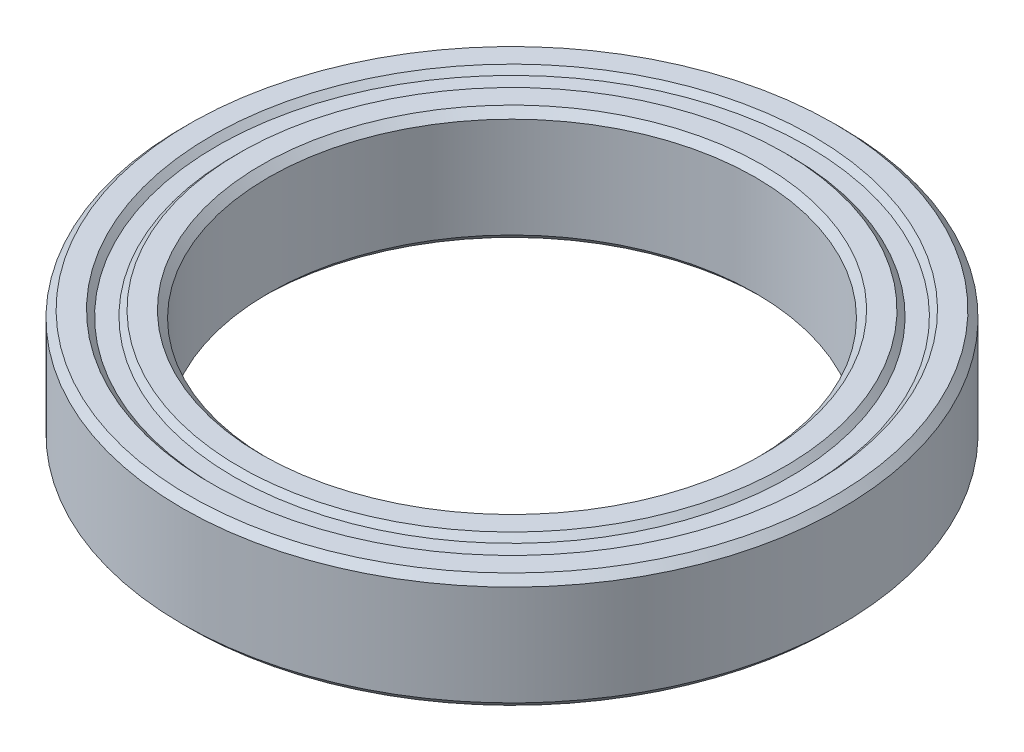
ISO-10303-21;
HEADER;
FILE_DESCRIPTION(('STEP AP214'),'2;1');
FILE_NAME('part.step','',(''),(''),'','','');
FILE_SCHEMA(('AUTOMOTIVE_DESIGN { 1 0 10303 214 1 1 1 1 }'));
ENDSEC;
DATA;
#1=APPLICATION_CONTEXT('core data for automotive mechanical design processes');
#2=APPLICATION_PROTOCOL_DEFINITION('international standard','automotive_design',2000,#1);
#3=PRODUCT_CONTEXT('',#1,'mechanical');
#4=PRODUCT('Part','Part','',(#3));
#5=PRODUCT_RELATED_PRODUCT_CATEGORY('part','',(#4));
#6=PRODUCT_DEFINITION_FORMATION('','',#4);
#7=PRODUCT_DEFINITION_CONTEXT('part definition',#1,'design');
#8=PRODUCT_DEFINITION('design','',#6,#7);
#9=PRODUCT_DEFINITION_SHAPE('','',#8);
#10=(LENGTH_UNIT() NAMED_UNIT(*) SI_UNIT(.MILLI.,.METRE.));
#11=(NAMED_UNIT(*) PLANE_ANGLE_UNIT() SI_UNIT($,.RADIAN.));
#12=(NAMED_UNIT(*) SI_UNIT($,.STERADIAN.) SOLID_ANGLE_UNIT());
#13=UNCERTAINTY_MEASURE_WITH_UNIT(LENGTH_MEASURE(1.E-05),#10,'distance_accuracy_value','');
#14=(GEOMETRIC_REPRESENTATION_CONTEXT(3) GLOBAL_UNCERTAINTY_ASSIGNED_CONTEXT((#13)) GLOBAL_UNIT_ASSIGNED_CONTEXT((#10,
#11,#12)) REPRESENTATION_CONTEXT('',''));
#15=CARTESIAN_POINT('',(0.,0.,0.));
#16=DIRECTION('',(0.,0.,1.));
#17=DIRECTION('',(1.,0.,0.));
#18=AXIS2_PLACEMENT_3D('',#15,#16,#17);
#19=CARTESIAN_POINT('',(0.,2.,0.));
#20=DIRECTION('',(0.,1.,0.));
#21=DIRECTION('',(0.,0.,1.));
#22=AXIS2_PLACEMENT_3D('',#19,#20,#21);
#23=CONICAL_SURFACE('',#22,8.75,0.785398163397448);
#24=CARTESIAN_POINT('',(0.,1.75,0.));
#25=DIRECTION('',(0.,-1.,0.));
#26=DIRECTION('',(0.,0.,-1.));
#27=AXIS2_PLACEMENT_3D('',#24,#25,#26);
#28=CIRCLE('',#27,8.5);
#29=CARTESIAN_POINT('',(0.,1.75,-8.5));
#30=VERTEX_POINT('',#29);
#31=EDGE_CURVE('E10',#30,#30,#28,.T.);
#32=ORIENTED_EDGE('',*,*,#31,.T.);
#33=EDGE_LOOP('',(#32));
#34=FACE_BOUND('',#33,.T.);
#35=CARTESIAN_POINT('',(0.,2.,0.));
#36=DIRECTION('',(0.,-1.,0.));
#37=DIRECTION('',(0.,0.,-1.));
#38=AXIS2_PLACEMENT_3D('',#35,#36,#37);
#39=CIRCLE('',#38,8.75);
#40=CARTESIAN_POINT('',(0.,2.,-8.75));
#41=VERTEX_POINT('',#40);
#42=EDGE_CURVE('E89',#41,#41,#39,.T.);
#43=ORIENTED_EDGE('',*,*,#42,.F.);
#44=EDGE_LOOP('',(#43));
#45=FACE_BOUND('',#44,.T.);
#46=ADVANCED_FACE('F37',(#34,#45),#23,.F.);
#47=CARTESIAN_POINT('',(0.,-1.34942197217015,0.));
#48=DIRECTION('',(0.,-1.,0.));
#49=DIRECTION('',(0.,0.,-1.));
#50=AXIS2_PLACEMENT_3D('',#47,#48,#49);
#51=CYLINDRICAL_SURFACE('',#50,8.5);
#52=CARTESIAN_POINT('',(0.,-1.75,0.));
#53=DIRECTION('',(0.,-1.,0.));
#54=DIRECTION('',(0.,0.,-1.));
#55=AXIS2_PLACEMENT_3D('',#52,#53,#54);
#56=CIRCLE('',#55,8.5);
#57=CARTESIAN_POINT('',(0.,-1.75,-8.5));
#58=VERTEX_POINT('',#57);
#59=EDGE_CURVE('E43',#58,#58,#56,.T.);
#60=ORIENTED_EDGE('',*,*,#59,.T.);
#61=EDGE_LOOP('',(#60));
#62=FACE_BOUND('',#61,.T.);
#63=ORIENTED_EDGE('',*,*,#31,.F.);
#64=EDGE_LOOP('',(#63));
#65=FACE_BOUND('',#64,.T.);
#66=ADVANCED_FACE('F97',(#62,#65),#51,.F.);
#67=CARTESIAN_POINT('',(0.,-1.75,0.));
#68=DIRECTION('',(0.,-1.,0.));
#69=DIRECTION('',(0.,0.,-1.));
#70=AXIS2_PLACEMENT_3D('',#67,#68,#69);
#71=CONICAL_SURFACE('',#70,8.5,0.785398163397449);
#72=CARTESIAN_POINT('',(0.,-2.,0.));
#73=DIRECTION('',(0.,-1.,0.));
#74=DIRECTION('',(0.,0.,-1.));
#75=AXIS2_PLACEMENT_3D('',#72,#73,#74);
#76=CIRCLE('',#75,8.75);
#77=CARTESIAN_POINT('',(0.,-2.,-8.75));
#78=VERTEX_POINT('',#77);
#79=EDGE_CURVE('E47',#78,#78,#76,.T.);
#80=ORIENTED_EDGE('',*,*,#79,.T.);
#81=EDGE_LOOP('',(#80));
#82=FACE_BOUND('',#81,.T.);
#83=ORIENTED_EDGE('',*,*,#59,.F.);
#84=EDGE_LOOP('',(#83));
#85=FACE_BOUND('',#84,.T.);
#86=ADVANCED_FACE('F101',(#82,#85),#71,.F.);
#87=CARTESIAN_POINT('',(8.75,-2.,0.));
#88=DIRECTION('',(0.,-1.,0.));
#89=DIRECTION('',(0.,0.,-1.));
#90=AXIS2_PLACEMENT_3D('',#87,#88,#89);
#91=PLANE('',#90);
#92=CARTESIAN_POINT('',(0.,-2.,0.));
#93=DIRECTION('',(0.,-1.,0.));
#94=DIRECTION('',(0.,0.,-1.));
#95=AXIS2_PLACEMENT_3D('',#92,#93,#94);
#96=CIRCLE('',#95,9.5);
#97=CARTESIAN_POINT('',(0.,-2.,-9.5));
#98=VERTEX_POINT('',#97);
#99=EDGE_CURVE('E51',#98,#98,#96,.T.);
#100=ORIENTED_EDGE('',*,*,#99,.T.);
#101=EDGE_LOOP('',(#100));
#102=FACE_BOUND('',#101,.T.);
#103=ORIENTED_EDGE('',*,*,#79,.F.);
#104=EDGE_LOOP('',(#103));
#105=FACE_BOUND('',#104,.T.);
#106=ADVANCED_FACE('F105',(#102,#105),#91,.T.);
#107=CARTESIAN_POINT('',(0.,-2.,0.));
#108=DIRECTION('',(0.,1.,0.));
#109=DIRECTION('',(0.,0.,1.));
#110=AXIS2_PLACEMENT_3D('',#107,#108,#109);
#111=CONICAL_SURFACE('',#110,9.5,0.78539816339745);
#112=CARTESIAN_POINT('',(0.,-1.8,0.));
#113=DIRECTION('',(0.,-1.,0.));
#114=DIRECTION('',(0.,0.,-1.));
#115=AXIS2_PLACEMENT_3D('',#112,#113,#114);
#116=CIRCLE('',#115,9.7);
#117=CARTESIAN_POINT('',(0.,-1.8,-9.7));
#118=VERTEX_POINT('',#117);
#119=EDGE_CURVE('E56',#118,#118,#116,.T.);
#120=ORIENTED_EDGE('',*,*,#119,.T.);
#121=EDGE_LOOP('',(#120));
#122=FACE_BOUND('',#121,.T.);
#123=ORIENTED_EDGE('',*,*,#99,.F.);
#124=EDGE_LOOP('',(#123));
#125=FACE_BOUND('',#124,.T.);
#126=ADVANCED_FACE('F112',(#122,#125),#111,.T.);
#127=CARTESIAN_POINT('',(9.7,-1.8,0.));
#128=DIRECTION('',(0.,-1.,0.));
#129=DIRECTION('',(0.,0.,-1.));
#130=AXIS2_PLACEMENT_3D('',#127,#128,#129);
#131=PLANE('',#130);
#132=CARTESIAN_POINT('',(0.,-1.8,0.));
#133=DIRECTION('',(0.,-1.,0.));
#134=DIRECTION('',(0.,0.,-1.));
#135=AXIS2_PLACEMENT_3D('',#132,#133,#134);
#136=CIRCLE('',#135,10.3);
#137=CARTESIAN_POINT('',(0.,-1.8,-10.3));
#138=VERTEX_POINT('',#137);
#139=EDGE_CURVE('E59',#138,#138,#136,.T.);
#140=ORIENTED_EDGE('',*,*,#139,.T.);
#141=EDGE_LOOP('',(#140));
#142=FACE_BOUND('',#141,.T.);
#143=ORIENTED_EDGE('',*,*,#119,.F.);
#144=EDGE_LOOP('',(#143));
#145=FACE_BOUND('',#144,.T.);
#146=ADVANCED_FACE('F116',(#142,#145),#131,.T.);
#147=CARTESIAN_POINT('',(0.,-1.8,0.));
#148=DIRECTION('',(0.,-1.,0.));
#149=DIRECTION('',(0.,0.,-1.));
#150=AXIS2_PLACEMENT_3D('',#147,#148,#149);
#151=CONICAL_SURFACE('',#150,10.3,0.78539816339745);
#152=CARTESIAN_POINT('',(0.,-2.,0.));
#153=DIRECTION('',(0.,-1.,0.));
#154=DIRECTION('',(0.,0.,-1.));
#155=AXIS2_PLACEMENT_3D('',#152,#153,#154);
#156=CIRCLE('',#155,10.5);
#157=CARTESIAN_POINT('',(0.,-2.,-10.5));
#158=VERTEX_POINT('',#157);
#159=EDGE_CURVE('E62',#158,#158,#156,.T.);
#160=ORIENTED_EDGE('',*,*,#159,.T.);
#161=EDGE_LOOP('',(#160));
#162=FACE_BOUND('',#161,.T.);
#163=ORIENTED_EDGE('',*,*,#139,.F.);
#164=EDGE_LOOP('',(#163));
#165=FACE_BOUND('',#164,.T.);
#166=ADVANCED_FACE('F120',(#162,#165),#151,.F.);
#167=CARTESIAN_POINT('',(10.5,-2.,0.));
#168=DIRECTION('',(0.,-1.,0.));
#169=DIRECTION('',(0.,0.,-1.));
#170=AXIS2_PLACEMENT_3D('',#167,#168,#169);
#171=PLANE('',#170);
#172=CARTESIAN_POINT('',(0.,-2.,0.));
#173=DIRECTION('',(0.,-1.,0.));
#174=DIRECTION('',(0.,0.,-1.));
#175=AXIS2_PLACEMENT_3D('',#172,#173,#174);
#176=CIRCLE('',#175,11.25);
#177=CARTESIAN_POINT('',(0.,-2.,-11.25));
#178=VERTEX_POINT('',#177);
#179=EDGE_CURVE('E65',#178,#178,#176,.T.);
#180=ORIENTED_EDGE('',*,*,#179,.T.);
#181=EDGE_LOOP('',(#180));
#182=FACE_BOUND('',#181,.T.);
#183=ORIENTED_EDGE('',*,*,#159,.F.);
#184=EDGE_LOOP('',(#183));
#185=FACE_BOUND('',#184,.T.);
#186=ADVANCED_FACE('F124',(#182,#185),#171,.T.);
#187=CARTESIAN_POINT('',(0.,-2.,0.));
#188=DIRECTION('',(0.,1.,0.));
#189=DIRECTION('',(0.,0.,1.));
#190=AXIS2_PLACEMENT_3D('',#187,#188,#189);
#191=CONICAL_SURFACE('',#190,11.25,0.785398163397449);
#192=CARTESIAN_POINT('',(0.,-1.75,0.));
#193=DIRECTION('',(0.,-1.,0.));
#194=DIRECTION('',(0.,0.,-1.));
#195=AXIS2_PLACEMENT_3D('',#192,#193,#194);
#196=CIRCLE('',#195,11.5);
#197=CARTESIAN_POINT('',(0.,-1.75,-11.5));
#198=VERTEX_POINT('',#197);
#199=EDGE_CURVE('E68',#198,#198,#196,.T.);
#200=ORIENTED_EDGE('',*,*,#199,.T.);
#201=EDGE_LOOP('',(#200));
#202=FACE_BOUND('',#201,.T.);
#203=ORIENTED_EDGE('',*,*,#179,.F.);
#204=EDGE_LOOP('',(#203));
#205=FACE_BOUND('',#204,.T.);
#206=ADVANCED_FACE('F128',(#202,#205),#191,.T.);
#207=CARTESIAN_POINT('',(0.,-1.34942197217015,0.));
#208=DIRECTION('',(0.,-1.,0.));
#209=DIRECTION('',(0.,0.,-1.));
#210=AXIS2_PLACEMENT_3D('',#207,#208,#209);
#211=CYLINDRICAL_SURFACE('',#210,11.5);
#212=CARTESIAN_POINT('',(0.,1.75,0.));
#213=DIRECTION('',(0.,-1.,0.));
#214=DIRECTION('',(0.,0.,-1.));
#215=AXIS2_PLACEMENT_3D('',#212,#213,#214);
#216=CIRCLE('',#215,11.5);
#217=CARTESIAN_POINT('',(0.,1.75,-11.5));
#218=VERTEX_POINT('',#217);
#219=EDGE_CURVE('E71',#218,#218,#216,.T.);
#220=ORIENTED_EDGE('',*,*,#219,.T.);
#221=EDGE_LOOP('',(#220));
#222=FACE_BOUND('',#221,.T.);
#223=ORIENTED_EDGE('',*,*,#199,.F.);
#224=EDGE_LOOP('',(#223));
#225=FACE_BOUND('',#224,.T.);
#226=ADVANCED_FACE('F132',(#222,#225),#211,.T.);
#227=CARTESIAN_POINT('',(0.,1.75,0.));
#228=DIRECTION('',(0.,-1.,0.));
#229=DIRECTION('',(0.,0.,-1.));
#230=AXIS2_PLACEMENT_3D('',#227,#228,#229);
#231=CONICAL_SURFACE('',#230,11.5,0.785398163397451);
#232=CARTESIAN_POINT('',(0.,2.,0.));
#233=DIRECTION('',(0.,-1.,0.));
#234=DIRECTION('',(0.,0.,-1.));
#235=AXIS2_PLACEMENT_3D('',#232,#233,#234);
#236=CIRCLE('',#235,11.25);
#237=CARTESIAN_POINT('',(0.,2.,-11.25));
#238=VERTEX_POINT('',#237);
#239=EDGE_CURVE('E74',#238,#238,#236,.T.);
#240=ORIENTED_EDGE('',*,*,#239,.T.);
#241=EDGE_LOOP('',(#240));
#242=FACE_BOUND('',#241,.T.);
#243=ORIENTED_EDGE('',*,*,#219,.F.);
#244=EDGE_LOOP('',(#243));
#245=FACE_BOUND('',#244,.T.);
#246=ADVANCED_FACE('F136',(#242,#245),#231,.T.);
#247=CARTESIAN_POINT('',(11.25,2.,0.));
#248=DIRECTION('',(0.,1.,0.));
#249=DIRECTION('',(0.,0.,1.));
#250=AXIS2_PLACEMENT_3D('',#247,#248,#249);
#251=PLANE('',#250);
#252=CARTESIAN_POINT('',(0.,2.,0.));
#253=DIRECTION('',(0.,-1.,0.));
#254=DIRECTION('',(0.,0.,-1.));
#255=AXIS2_PLACEMENT_3D('',#252,#253,#254);
#256=CIRCLE('',#255,10.5);
#257=CARTESIAN_POINT('',(0.,2.,-10.5));
#258=VERTEX_POINT('',#257);
#259=EDGE_CURVE('E77',#258,#258,#256,.T.);
#260=ORIENTED_EDGE('',*,*,#259,.T.);
#261=EDGE_LOOP('',(#260));
#262=FACE_BOUND('',#261,.T.);
#263=ORIENTED_EDGE('',*,*,#239,.F.);
#264=EDGE_LOOP('',(#263));
#265=FACE_BOUND('',#264,.T.);
#266=ADVANCED_FACE('F140',(#262,#265),#251,.T.);
#267=CARTESIAN_POINT('',(0.,2.,0.));
#268=DIRECTION('',(0.,1.,0.));
#269=DIRECTION('',(0.,0.,1.));
#270=AXIS2_PLACEMENT_3D('',#267,#268,#269);
#271=CONICAL_SURFACE('',#270,10.5,0.785398163397444);
#272=CARTESIAN_POINT('',(0.,1.8,0.));
#273=DIRECTION('',(0.,-1.,0.));
#274=DIRECTION('',(0.,0.,-1.));
#275=AXIS2_PLACEMENT_3D('',#272,#273,#274);
#276=CIRCLE('',#275,10.3);
#277=CARTESIAN_POINT('',(0.,1.8,-10.3));
#278=VERTEX_POINT('',#277);
#279=EDGE_CURVE('E80',#278,#278,#276,.T.);
#280=ORIENTED_EDGE('',*,*,#279,.T.);
#281=EDGE_LOOP('',(#280));
#282=FACE_BOUND('',#281,.T.);
#283=ORIENTED_EDGE('',*,*,#259,.F.);
#284=EDGE_LOOP('',(#283));
#285=FACE_BOUND('',#284,.T.);
#286=ADVANCED_FACE('F144',(#282,#285),#271,.F.);
#287=CARTESIAN_POINT('',(10.3,1.8,0.));
#288=DIRECTION('',(0.,1.,0.));
#289=DIRECTION('',(0.,0.,1.));
#290=AXIS2_PLACEMENT_3D('',#287,#288,#289);
#291=PLANE('',#290);
#292=CARTESIAN_POINT('',(0.,1.8,0.));
#293=DIRECTION('',(0.,-1.,0.));
#294=DIRECTION('',(0.,0.,-1.));
#295=AXIS2_PLACEMENT_3D('',#292,#293,#294);
#296=CIRCLE('',#295,9.7);
#297=CARTESIAN_POINT('',(0.,1.8,-9.7));
#298=VERTEX_POINT('',#297);
#299=EDGE_CURVE('E83',#298,#298,#296,.T.);
#300=ORIENTED_EDGE('',*,*,#299,.T.);
#301=EDGE_LOOP('',(#300));
#302=FACE_BOUND('',#301,.T.);
#303=ORIENTED_EDGE('',*,*,#279,.F.);
#304=EDGE_LOOP('',(#303));
#305=FACE_BOUND('',#304,.T.);
#306=ADVANCED_FACE('F148',(#302,#305),#291,.T.);
#307=CARTESIAN_POINT('',(0.,1.8,0.));
#308=DIRECTION('',(0.,-1.,0.));
#309=DIRECTION('',(0.,0.,-1.));
#310=AXIS2_PLACEMENT_3D('',#307,#308,#309);
#311=CONICAL_SURFACE('',#310,9.7,0.785398163397449);
#312=CARTESIAN_POINT('',(0.,2.,0.));
#313=DIRECTION('',(0.,-1.,0.));
#314=DIRECTION('',(0.,0.,-1.));
#315=AXIS2_PLACEMENT_3D('',#312,#313,#314);
#316=CIRCLE('',#315,9.5);
#317=CARTESIAN_POINT('',(0.,2.,-9.5));
#318=VERTEX_POINT('',#317);
#319=EDGE_CURVE('E86',#318,#318,#316,.T.);
#320=ORIENTED_EDGE('',*,*,#319,.T.);
#321=EDGE_LOOP('',(#320));
#322=FACE_BOUND('',#321,.T.);
#323=ORIENTED_EDGE('',*,*,#299,.F.);
#324=EDGE_LOOP('',(#323));
#325=FACE_BOUND('',#324,.T.);
#326=ADVANCED_FACE('F152',(#322,#325),#311,.T.);
#327=CARTESIAN_POINT('',(9.5,2.,0.));
#328=DIRECTION('',(0.,1.,0.));
#329=DIRECTION('',(0.,0.,1.));
#330=AXIS2_PLACEMENT_3D('',#327,#328,#329);
#331=PLANE('',#330);
#332=ORIENTED_EDGE('',*,*,#42,.T.);
#333=EDGE_LOOP('',(#332));
#334=FACE_BOUND('',#333,.T.);
#335=ORIENTED_EDGE('',*,*,#319,.F.);
#336=EDGE_LOOP('',(#335));
#337=FACE_BOUND('',#336,.T.);
#338=ADVANCED_FACE('F93',(#334,#337),#331,.T.);
#339=CLOSED_SHELL('',(#46,#66,#86,#106,#126,#146,#166,#186,#206,#226,#246,#266,#286,#306,#326,#338));
#340=MANIFOLD_SOLID_BREP('B2',#339);
#341=ADVANCED_BREP_SHAPE_REPRESENTATION('',(#18,#340),#14);
#342=SHAPE_DEFINITION_REPRESENTATION(#9,#341);
ENDSEC;
END-ISO-10303-21;
